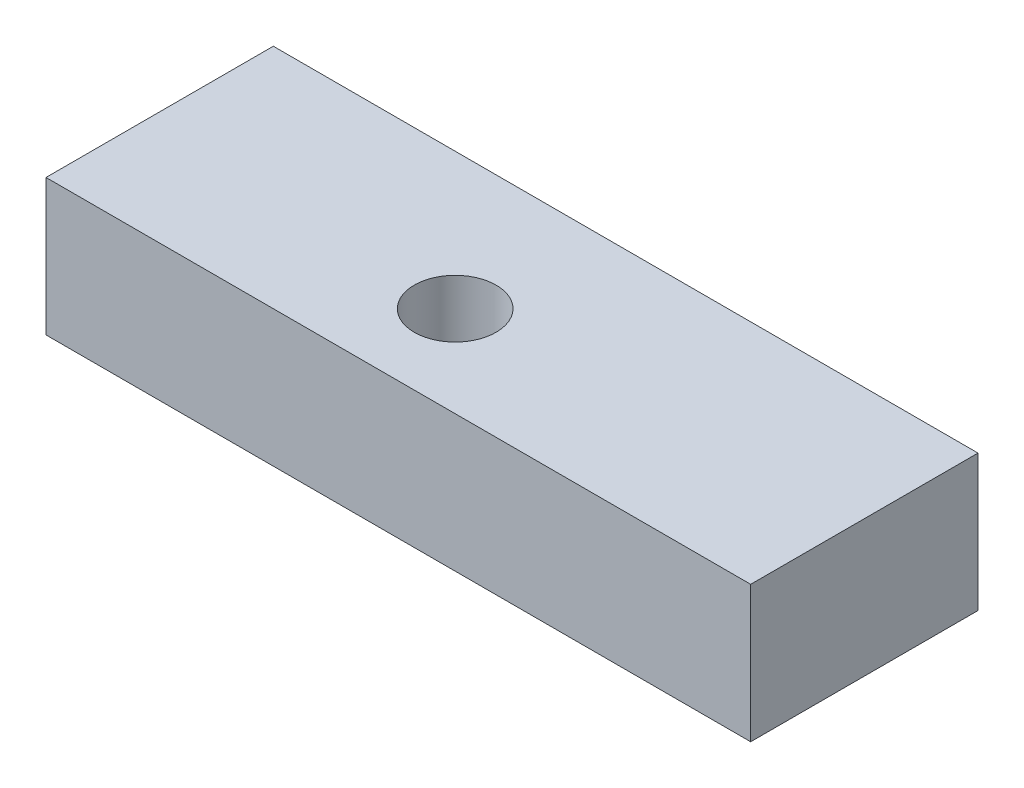
ISO-10303-21;
HEADER;
FILE_DESCRIPTION(('STEP AP214'),'2;1');
FILE_NAME('part.step','',(''),(''),'','','');
FILE_SCHEMA(('AUTOMOTIVE_DESIGN { 1 0 10303 214 1 1 1 1 }'));
ENDSEC;
DATA;
#1=APPLICATION_CONTEXT('core data for automotive mechanical design processes');
#2=APPLICATION_PROTOCOL_DEFINITION('international standard','automotive_design',2000,#1);
#3=PRODUCT_CONTEXT('',#1,'mechanical');
#4=PRODUCT('Part','Part','',(#3));
#5=PRODUCT_RELATED_PRODUCT_CATEGORY('part','',(#4));
#6=PRODUCT_DEFINITION_FORMATION('','',#4);
#7=PRODUCT_DEFINITION_CONTEXT('part definition',#1,'design');
#8=PRODUCT_DEFINITION('design','',#6,#7);
#9=PRODUCT_DEFINITION_SHAPE('','',#8);
#10=(LENGTH_UNIT() NAMED_UNIT(*) SI_UNIT(.MILLI.,.METRE.));
#11=(NAMED_UNIT(*) PLANE_ANGLE_UNIT() SI_UNIT($,.RADIAN.));
#12=(NAMED_UNIT(*) SI_UNIT($,.STERADIAN.) SOLID_ANGLE_UNIT());
#13=UNCERTAINTY_MEASURE_WITH_UNIT(LENGTH_MEASURE(1.E-05),#10,'distance_accuracy_value','');
#14=(GEOMETRIC_REPRESENTATION_CONTEXT(3) GLOBAL_UNCERTAINTY_ASSIGNED_CONTEXT((#13)) GLOBAL_UNIT_ASSIGNED_CONTEXT((#10,
#11,#12)) REPRESENTATION_CONTEXT('',''));
#15=CARTESIAN_POINT('',(0.,0.,0.));
#16=DIRECTION('',(0.,0.,1.));
#17=DIRECTION('',(1.,0.,0.));
#18=AXIS2_PLACEMENT_3D('',#15,#16,#17);
#19=CARTESIAN_POINT('',(0.,30.,0.));
#20=DIRECTION('',(0.,1.,0.));
#21=DIRECTION('',(0.,0.,1.));
#22=AXIS2_PLACEMENT_3D('',#19,#20,#21);
#23=PLANE('',#22);
#24=DIRECTION('',(0.,0.,1.));
#25=VECTOR('',#24,1.);
#26=CARTESIAN_POINT('',(-70.,30.,-30.));
#27=LINE('',#26,#25);
#28=CARTESIAN_POINT('',(-70.,30.,-30.));
#29=VERTEX_POINT('',#28);
#30=CARTESIAN_POINT('',(-70.,30.,20.));
#31=VERTEX_POINT('',#30);
#32=EDGE_CURVE('E94',#29,#31,#27,.T.);
#33=ORIENTED_EDGE('',*,*,#32,.T.);
#34=DIRECTION('',(1.,0.,0.));
#35=VECTOR('',#34,1.);
#36=CARTESIAN_POINT('',(-70.,30.,20.));
#37=LINE('',#36,#35);
#38=CARTESIAN_POINT('',(85.,30.,20.));
#39=VERTEX_POINT('',#38);
#40=EDGE_CURVE('E89',#31,#39,#37,.T.);
#41=ORIENTED_EDGE('',*,*,#40,.T.);
#42=DIRECTION('',(0.,0.,-1.));
#43=VECTOR('',#42,1.);
#44=CARTESIAN_POINT('',(85.,30.,-30.));
#45=LINE('',#44,#43);
#46=CARTESIAN_POINT('',(85.,30.,-30.));
#47=VERTEX_POINT('',#46);
#48=EDGE_CURVE('E92',#39,#47,#45,.T.);
#49=ORIENTED_EDGE('',*,*,#48,.T.);
#50=DIRECTION('',(-1.,0.,0.));
#51=VECTOR('',#50,1.);
#52=CARTESIAN_POINT('',(-70.,30.,-30.));
#53=LINE('',#52,#51);
#54=EDGE_CURVE('E59',#47,#29,#53,.T.);
#55=ORIENTED_EDGE('',*,*,#54,.T.);
#56=EDGE_LOOP('',(#33,#41,#49,#55));
#57=FACE_BOUND('',#56,.T.);
#58=CARTESIAN_POINT('',(0.,30.,0.));
#59=DIRECTION('',(0.,1.,0.));
#60=DIRECTION('',(0.,0.,1.));
#61=AXIS2_PLACEMENT_3D('',#58,#59,#60);
#62=CIRCLE('',#61,9.);
#63=CARTESIAN_POINT('',(0.,30.,9.));
#64=VERTEX_POINT('',#63);
#65=EDGE_CURVE('E114',#64,#64,#62,.T.);
#66=ORIENTED_EDGE('',*,*,#65,.F.);
#67=EDGE_LOOP('',(#66));
#68=FACE_BOUND('',#67,.T.);
#69=ADVANCED_FACE('F41',(#57,#68),#23,.T.);
#70=CARTESIAN_POINT('',(0.,0.,0.));
#71=DIRECTION('',(0.,1.,0.));
#72=DIRECTION('',(0.,0.,1.));
#73=AXIS2_PLACEMENT_3D('',#70,#71,#72);
#74=PLANE('',#73);
#75=DIRECTION('',(0.,0.,1.));
#76=VECTOR('',#75,1.);
#77=CARTESIAN_POINT('',(-70.,0.,-30.));
#78=LINE('',#77,#76);
#79=CARTESIAN_POINT('',(-70.,0.,-30.));
#80=VERTEX_POINT('',#79);
#81=CARTESIAN_POINT('',(-70.,0.,20.));
#82=VERTEX_POINT('',#81);
#83=EDGE_CURVE('E110',#80,#82,#78,.T.);
#84=ORIENTED_EDGE('',*,*,#83,.F.);
#85=DIRECTION('',(-1.,0.,0.));
#86=VECTOR('',#85,1.);
#87=CARTESIAN_POINT('',(-70.,0.,-30.));
#88=LINE('',#87,#86);
#89=CARTESIAN_POINT('',(85.,0.,-30.));
#90=VERTEX_POINT('',#89);
#91=EDGE_CURVE('E82',#90,#80,#88,.T.);
#92=ORIENTED_EDGE('',*,*,#91,.F.);
#93=DIRECTION('',(0.,0.,-1.));
#94=VECTOR('',#93,1.);
#95=CARTESIAN_POINT('',(85.,0.,-30.));
#96=LINE('',#95,#94);
#97=CARTESIAN_POINT('',(85.,0.,20.));
#98=VERTEX_POINT('',#97);
#99=EDGE_CURVE('E76',#98,#90,#96,.T.);
#100=ORIENTED_EDGE('',*,*,#99,.F.);
#101=DIRECTION('',(1.,0.,0.));
#102=VECTOR('',#101,1.);
#103=CARTESIAN_POINT('',(-70.,0.,20.));
#104=LINE('',#103,#102);
#105=EDGE_CURVE('E99',#82,#98,#104,.T.);
#106=ORIENTED_EDGE('',*,*,#105,.F.);
#107=EDGE_LOOP('',(#84,#92,#100,#106));
#108=FACE_BOUND('',#107,.T.);
#109=CARTESIAN_POINT('',(0.,0.,0.));
#110=DIRECTION('',(0.,1.,0.));
#111=DIRECTION('',(0.,0.,1.));
#112=AXIS2_PLACEMENT_3D('',#109,#110,#111);
#113=CIRCLE('',#112,9.);
#114=CARTESIAN_POINT('',(0.,0.,9.));
#115=VERTEX_POINT('',#114);
#116=EDGE_CURVE('E132',#115,#115,#113,.T.);
#117=ORIENTED_EDGE('',*,*,#116,.T.);
#118=EDGE_LOOP('',(#117));
#119=FACE_BOUND('',#118,.T.);
#120=ADVANCED_FACE('F127',(#108,#119),#74,.F.);
#121=CARTESIAN_POINT('',(-70.,30.,-30.));
#122=DIRECTION('',(1.,0.,0.));
#123=DIRECTION('',(0.,0.,-1.));
#124=AXIS2_PLACEMENT_3D('',#121,#122,#123);
#125=PLANE('',#124);
#126=ORIENTED_EDGE('',*,*,#83,.T.);
#127=DIRECTION('',(0.,-1.,0.));
#128=VECTOR('',#127,1.);
#129=CARTESIAN_POINT('',(-70.,30.,20.));
#130=LINE('',#129,#128);
#131=EDGE_CURVE('E11',#31,#82,#130,.T.);
#132=ORIENTED_EDGE('',*,*,#131,.F.);
#133=ORIENTED_EDGE('',*,*,#32,.F.);
#134=DIRECTION('',(0.,-1.,0.));
#135=VECTOR('',#134,1.);
#136=CARTESIAN_POINT('',(-70.,30.,-30.));
#137=LINE('',#136,#135);
#138=EDGE_CURVE('E106',#29,#80,#137,.T.);
#139=ORIENTED_EDGE('',*,*,#138,.T.);
#140=EDGE_LOOP('',(#126,#132,#133,#139));
#141=FACE_BOUND('',#140,.T.);
#142=ADVANCED_FACE('F43',(#141),#125,.F.);
#143=CARTESIAN_POINT('',(-70.,30.,20.));
#144=DIRECTION('',(0.,0.,-1.));
#145=DIRECTION('',(-1.,0.,0.));
#146=AXIS2_PLACEMENT_3D('',#143,#144,#145);
#147=PLANE('',#146);
#148=ORIENTED_EDGE('',*,*,#105,.T.);
#149=DIRECTION('',(0.,-1.,0.));
#150=VECTOR('',#149,1.);
#151=CARTESIAN_POINT('',(85.,30.,20.));
#152=LINE('',#151,#150);
#153=EDGE_CURVE('E51',#39,#98,#152,.T.);
#154=ORIENTED_EDGE('',*,*,#153,.F.);
#155=ORIENTED_EDGE('',*,*,#40,.F.);
#156=ORIENTED_EDGE('',*,*,#131,.T.);
#157=EDGE_LOOP('',(#148,#154,#155,#156));
#158=FACE_BOUND('',#157,.T.);
#159=ADVANCED_FACE('F98',(#158),#147,.F.);
#160=CARTESIAN_POINT('',(85.,30.,-30.));
#161=DIRECTION('',(-1.,0.,0.));
#162=DIRECTION('',(0.,0.,1.));
#163=AXIS2_PLACEMENT_3D('',#160,#161,#162);
#164=PLANE('',#163);
#165=ORIENTED_EDGE('',*,*,#99,.T.);
#166=DIRECTION('',(0.,-1.,0.));
#167=VECTOR('',#166,1.);
#168=CARTESIAN_POINT('',(85.,30.,-30.));
#169=LINE('',#168,#167);
#170=EDGE_CURVE('E101',#47,#90,#169,.T.);
#171=ORIENTED_EDGE('',*,*,#170,.F.);
#172=ORIENTED_EDGE('',*,*,#48,.F.);
#173=ORIENTED_EDGE('',*,*,#153,.T.);
#174=EDGE_LOOP('',(#165,#171,#172,#173));
#175=FACE_BOUND('',#174,.T.);
#176=ADVANCED_FACE('F102',(#175),#164,.F.);
#177=CARTESIAN_POINT('',(-70.,30.,-30.));
#178=DIRECTION('',(0.,0.,1.));
#179=DIRECTION('',(1.,0.,0.));
#180=AXIS2_PLACEMENT_3D('',#177,#178,#179);
#181=PLANE('',#180);
#182=ORIENTED_EDGE('',*,*,#91,.T.);
#183=ORIENTED_EDGE('',*,*,#138,.F.);
#184=ORIENTED_EDGE('',*,*,#54,.F.);
#185=ORIENTED_EDGE('',*,*,#170,.T.);
#186=EDGE_LOOP('',(#182,#183,#184,#185));
#187=FACE_BOUND('',#186,.T.);
#188=ADVANCED_FACE('F124',(#187),#181,.F.);
#189=CARTESIAN_POINT('',(0.,30.,0.));
#190=DIRECTION('',(0.,-1.,0.));
#191=DIRECTION('',(0.,0.,-1.));
#192=AXIS2_PLACEMENT_3D('',#189,#190,#191);
#193=CYLINDRICAL_SURFACE('',#192,9.);
#194=ORIENTED_EDGE('',*,*,#65,.T.);
#195=EDGE_LOOP('',(#194));
#196=FACE_BOUND('',#195,.T.);
#197=ORIENTED_EDGE('',*,*,#116,.F.);
#198=EDGE_LOOP('',(#197));
#199=FACE_BOUND('',#198,.T.);
#200=ADVANCED_FACE('F140',(#196,#199),#193,.F.);
#201=CLOSED_SHELL('',(#69,#120,#142,#159,#176,#188,#200));
#202=MANIFOLD_SOLID_BREP('B2',#201);
#203=ADVANCED_BREP_SHAPE_REPRESENTATION('',(#18,#202),#14);
#204=SHAPE_DEFINITION_REPRESENTATION(#9,#203);
ENDSEC;
END-ISO-10303-21;
